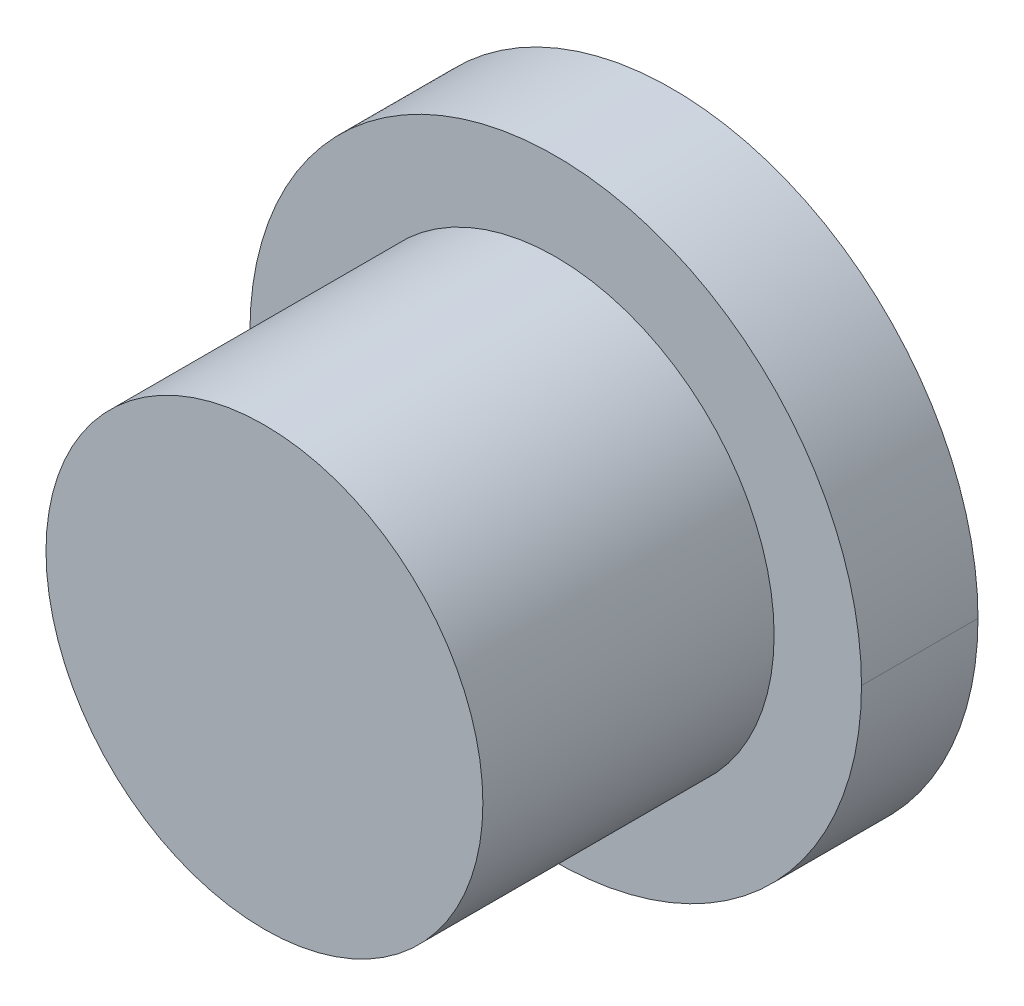
ISO-10303-21;
HEADER;
FILE_DESCRIPTION(('STEP AP214'),'2;1');
FILE_NAME('part.step','',(''),(''),'','','');
FILE_SCHEMA(('AUTOMOTIVE_DESIGN { 1 0 10303 214 1 1 1 1 }'));
ENDSEC;
DATA;
#1=APPLICATION_CONTEXT('core data for automotive mechanical design processes');
#2=APPLICATION_PROTOCOL_DEFINITION('international standard','automotive_design',2000,#1);
#3=PRODUCT_CONTEXT('',#1,'mechanical');
#4=PRODUCT('Part','Part','',(#3));
#5=PRODUCT_RELATED_PRODUCT_CATEGORY('part','',(#4));
#6=PRODUCT_DEFINITION_FORMATION('','',#4);
#7=PRODUCT_DEFINITION_CONTEXT('part definition',#1,'design');
#8=PRODUCT_DEFINITION('design','',#6,#7);
#9=PRODUCT_DEFINITION_SHAPE('','',#8);
#10=(LENGTH_UNIT() NAMED_UNIT(*) SI_UNIT(.MILLI.,.METRE.));
#11=(NAMED_UNIT(*) PLANE_ANGLE_UNIT() SI_UNIT($,.RADIAN.));
#12=(NAMED_UNIT(*) SI_UNIT($,.STERADIAN.) SOLID_ANGLE_UNIT());
#13=UNCERTAINTY_MEASURE_WITH_UNIT(LENGTH_MEASURE(1.E-05),#10,'distance_accuracy_value','');
#14=(GEOMETRIC_REPRESENTATION_CONTEXT(3) GLOBAL_UNCERTAINTY_ASSIGNED_CONTEXT((#13)) GLOBAL_UNIT_ASSIGNED_CONTEXT((#10,
#11,#12)) REPRESENTATION_CONTEXT('',''));
#15=CARTESIAN_POINT('',(0.,0.,0.));
#16=DIRECTION('',(0.,0.,1.));
#17=DIRECTION('',(1.,0.,0.));
#18=AXIS2_PLACEMENT_3D('',#15,#16,#17);
#19=CARTESIAN_POINT('',(0.,0.,-4.));
#20=DIRECTION('',(0.,0.,1.));
#21=DIRECTION('',(1.,0.,0.));
#22=AXIS2_PLACEMENT_3D('',#19,#20,#21);
#23=CYLINDRICAL_SURFACE('',#22,10.5);
#24=CARTESIAN_POINT('',(0.,0.,-4.));
#25=DIRECTION('',(0.,0.,-1.));
#26=DIRECTION('',(-1.,0.,0.));
#27=AXIS2_PLACEMENT_3D('',#24,#25,#26);
#28=CIRCLE('',#27,10.5);
#29=CARTESIAN_POINT('',(-10.5,0.,-4.));
#30=VERTEX_POINT('',#29);
#31=CARTESIAN_POINT('',(10.5,0.,-4.));
#32=VERTEX_POINT('',#31);
#33=EDGE_CURVE('E75',#30,#32,#28,.T.);
#34=ORIENTED_EDGE('',*,*,#33,.F.);
#35=DIRECTION('',(0.,0.,1.));
#36=VECTOR('',#35,1.);
#37=CARTESIAN_POINT('',(-10.5,0.,-4.));
#38=LINE('',#37,#36);
#39=CARTESIAN_POINT('',(-10.5,0.,0.));
#40=VERTEX_POINT('',#39);
#41=EDGE_CURVE('E11',#30,#40,#38,.T.);
#42=ORIENTED_EDGE('',*,*,#41,.T.);
#43=CARTESIAN_POINT('',(0.,0.,0.));
#44=DIRECTION('',(0.,0.,-1.));
#45=DIRECTION('',(-1.,0.,0.));
#46=AXIS2_PLACEMENT_3D('',#43,#44,#45);
#47=CIRCLE('',#46,10.5);
#48=CARTESIAN_POINT('',(10.5,0.,0.));
#49=VERTEX_POINT('',#48);
#50=EDGE_CURVE('E62',#40,#49,#47,.T.);
#51=ORIENTED_EDGE('',*,*,#50,.T.);
#52=DIRECTION('',(0.,0.,1.));
#53=VECTOR('',#52,1.);
#54=CARTESIAN_POINT('',(10.5,0.,-4.));
#55=LINE('',#54,#53);
#56=EDGE_CURVE('E118',#32,#49,#55,.T.);
#57=ORIENTED_EDGE('',*,*,#56,.F.);
#58=EDGE_LOOP('',(#34,#42,#51,#57));
#59=FACE_BOUND('',#58,.T.);
#60=ADVANCED_FACE('F51',(#59),#23,.T.);
#61=CARTESIAN_POINT('',(0.,0.,5.));
#62=DIRECTION('',(0.,0.,-1.));
#63=DIRECTION('',(-1.,0.,0.));
#64=AXIS2_PLACEMENT_3D('',#61,#62,#63);
#65=CYLINDRICAL_SURFACE('',#64,7.5);
#66=DIRECTION('',(0.,0.,-1.));
#67=VECTOR('',#66,1.);
#68=CARTESIAN_POINT('',(-7.5,0.,5.));
#69=LINE('',#68,#67);
#70=CARTESIAN_POINT('',(-7.5,0.,5.));
#71=VERTEX_POINT('',#70);
#72=CARTESIAN_POINT('',(-7.5,0.,0.));
#73=VERTEX_POINT('',#72);
#74=EDGE_CURVE('E112',#71,#73,#69,.T.);
#75=ORIENTED_EDGE('',*,*,#74,.F.);
#76=ORIENTED_EDGE('',*,*,#74,.T.);
#77=CARTESIAN_POINT('',(0.,0.,0.));
#78=DIRECTION('',(0.,0.,1.));
#79=DIRECTION('',(1.,0.,0.));
#80=AXIS2_PLACEMENT_3D('',#77,#78,#79);
#81=CIRCLE('',#80,7.5);
#82=CARTESIAN_POINT('',(7.5,0.,0.));
#83=VERTEX_POINT('',#82);
#84=EDGE_CURVE('E109',#73,#83,#81,.T.);
#85=ORIENTED_EDGE('',*,*,#84,.T.);
#86=DIRECTION('',(0.,0.,-1.));
#87=VECTOR('',#86,1.);
#88=CARTESIAN_POINT('',(7.5,0.,5.));
#89=LINE('',#88,#87);
#90=CARTESIAN_POINT('',(7.5,0.,5.));
#91=VERTEX_POINT('',#90);
#92=EDGE_CURVE('E99',#91,#83,#89,.T.);
#93=ORIENTED_EDGE('',*,*,#92,.F.);
#94=ORIENTED_EDGE('',*,*,#92,.T.);
#95=CARTESIAN_POINT('',(0.,0.,0.));
#96=DIRECTION('',(0.,0.,1.));
#97=DIRECTION('',(1.,0.,0.));
#98=AXIS2_PLACEMENT_3D('',#95,#96,#97);
#99=CIRCLE('',#98,7.5);
#100=EDGE_CURVE('E107',#83,#73,#99,.T.);
#101=ORIENTED_EDGE('',*,*,#100,.T.);
#102=EDGE_LOOP('',(#75,#76,#85,#93,#94,#101));
#103=FACE_BOUND('',#102,.T.);
#104=CARTESIAN_POINT('',(0.,0.,10.));
#105=DIRECTION('',(0.,0.,1.));
#106=DIRECTION('',(1.,0.,0.));
#107=AXIS2_PLACEMENT_3D('',#104,#105,#106);
#108=CIRCLE('',#107,7.5);
#109=CARTESIAN_POINT('',(7.5,0.,10.));
#110=VERTEX_POINT('',#109);
#111=EDGE_CURVE('E196',#110,#110,#108,.T.);
#112=ORIENTED_EDGE('',*,*,#111,.F.);
#113=EDGE_LOOP('',(#112));
#114=FACE_BOUND('',#113,.T.);
#115=ADVANCED_FACE('F114',(#103,#114),#65,.T.);
#116=CARTESIAN_POINT('',(0.,0.,-4.));
#117=DIRECTION('',(0.,0.,1.));
#118=DIRECTION('',(1.,0.,0.));
#119=AXIS2_PLACEMENT_3D('',#116,#117,#118);
#120=CYLINDRICAL_SURFACE('',#119,10.5);
#121=ORIENTED_EDGE('',*,*,#41,.F.);
#122=CARTESIAN_POINT('',(0.,0.,-4.));
#123=DIRECTION('',(0.,0.,-1.));
#124=DIRECTION('',(-1.,0.,0.));
#125=AXIS2_PLACEMENT_3D('',#122,#123,#124);
#126=CIRCLE('',#125,10.5);
#127=EDGE_CURVE('E128',#32,#30,#126,.T.);
#128=ORIENTED_EDGE('',*,*,#127,.F.);
#129=ORIENTED_EDGE('',*,*,#56,.T.);
#130=CARTESIAN_POINT('',(0.,0.,0.));
#131=DIRECTION('',(0.,0.,-1.));
#132=DIRECTION('',(-1.,0.,0.));
#133=AXIS2_PLACEMENT_3D('',#130,#131,#132);
#134=CIRCLE('',#133,10.5);
#135=EDGE_CURVE('E124',#49,#40,#134,.T.);
#136=ORIENTED_EDGE('',*,*,#135,.T.);
#137=EDGE_LOOP('',(#121,#128,#129,#136));
#138=FACE_BOUND('',#137,.T.);
#139=ADVANCED_FACE('F159',(#138),#120,.T.);
#140=CARTESIAN_POINT('',(0.,0.,-4.));
#141=DIRECTION('',(0.,0.,-1.));
#142=DIRECTION('',(0.,-1.,0.));
#143=AXIS2_PLACEMENT_3D('',#140,#141,#142);
#144=PLANE('',#143);
#145=CARTESIAN_POINT('',(0.,0.,-4.));
#146=DIRECTION('',(0.,0.,-1.));
#147=DIRECTION('',(0.,1.,0.));
#148=AXIS2_PLACEMENT_3D('',#145,#146,#147);
#149=CIRCLE('',#148,9.75);
#150=CARTESIAN_POINT('',(0.,9.75,-4.));
#151=VERTEX_POINT('',#150);
#152=EDGE_CURVE('E149',#151,#151,#149,.T.);
#153=ORIENTED_EDGE('',*,*,#152,.F.);
#154=EDGE_LOOP('',(#153));
#155=FACE_BOUND('',#154,.T.);
#156=ORIENTED_EDGE('',*,*,#127,.T.);
#157=ORIENTED_EDGE('',*,*,#33,.T.);
#158=EDGE_LOOP('',(#156,#157));
#159=FACE_BOUND('',#158,.T.);
#160=ADVANCED_FACE('F160',(#155,#159),#144,.T.);
#161=CARTESIAN_POINT('',(0.,0.,0.));
#162=DIRECTION('',(0.,0.,-1.));
#163=DIRECTION('',(0.,-1.,0.));
#164=AXIS2_PLACEMENT_3D('',#161,#162,#163);
#165=PLANE('',#164);
#166=ORIENTED_EDGE('',*,*,#135,.F.);
#167=ORIENTED_EDGE('',*,*,#50,.F.);
#168=EDGE_LOOP('',(#166,#167));
#169=FACE_BOUND('',#168,.T.);
#170=ORIENTED_EDGE('',*,*,#84,.F.);
#171=ORIENTED_EDGE('',*,*,#100,.F.);
#172=EDGE_LOOP('',(#170,#171));
#173=FACE_BOUND('',#172,.T.);
#174=ADVANCED_FACE('F108',(#169,#173),#165,.F.);
#175=CARTESIAN_POINT('',(0.,0.,-4.));
#176=DIRECTION('',(0.,0.,-1.));
#177=DIRECTION('',(0.,1.,0.));
#178=AXIS2_PLACEMENT_3D('',#175,#176,#177);
#179=CONICAL_SURFACE('',#178,9.75,0.785398163397447);
#180=CARTESIAN_POINT('',(0.,0.,-3.25));
#181=DIRECTION('',(0.,0.,-1.));
#182=DIRECTION('',(0.,1.,0.));
#183=AXIS2_PLACEMENT_3D('',#180,#181,#182);
#184=CIRCLE('',#183,9.);
#185=CARTESIAN_POINT('',(0.,9.,-3.25));
#186=VERTEX_POINT('',#185);
#187=EDGE_CURVE('E143',#186,#186,#184,.T.);
#188=ORIENTED_EDGE('',*,*,#187,.F.);
#189=EDGE_LOOP('',(#188));
#190=FACE_BOUND('',#189,.T.);
#191=ORIENTED_EDGE('',*,*,#152,.T.);
#192=EDGE_LOOP('',(#191));
#193=FACE_BOUND('',#192,.T.);
#194=ADVANCED_FACE('F168',(#190,#193),#179,.F.);
#195=CARTESIAN_POINT('',(0.,0.,-1.));
#196=DIRECTION('',(0.,0.,-1.));
#197=DIRECTION('',(0.,-1.,0.));
#198=AXIS2_PLACEMENT_3D('',#195,#196,#197);
#199=PLANE('',#198);
#200=CARTESIAN_POINT('',(0.,0.,-1.));
#201=DIRECTION('',(0.,0.,-1.));
#202=DIRECTION('',(-1.,0.,0.));
#203=AXIS2_PLACEMENT_3D('',#200,#201,#202);
#204=CIRCLE('',#203,9.);
#205=CARTESIAN_POINT('',(-9.,0.,-1.));
#206=VERTEX_POINT('',#205);
#207=EDGE_CURVE('E136',#206,#206,#204,.T.);
#208=ORIENTED_EDGE('',*,*,#207,.T.);
#209=EDGE_LOOP('',(#208));
#210=FACE_BOUND('',#209,.T.);
#211=ADVANCED_FACE('F53',(#210),#199,.T.);
#212=CARTESIAN_POINT('',(0.,0.,-1.));
#213=DIRECTION('',(0.,0.,-1.));
#214=DIRECTION('',(-1.,0.,0.));
#215=AXIS2_PLACEMENT_3D('',#212,#213,#214);
#216=CYLINDRICAL_SURFACE('',#215,9.);
#217=ORIENTED_EDGE('',*,*,#187,.T.);
#218=EDGE_LOOP('',(#217));
#219=FACE_BOUND('',#218,.T.);
#220=ORIENTED_EDGE('',*,*,#207,.F.);
#221=EDGE_LOOP('',(#220));
#222=FACE_BOUND('',#221,.T.);
#223=ADVANCED_FACE('F182',(#219,#222),#216,.F.);
#224=CARTESIAN_POINT('',(0.,0.,10.));
#225=DIRECTION('',(0.,0.,1.));
#226=DIRECTION('',(1.,0.,0.));
#227=AXIS2_PLACEMENT_3D('',#224,#225,#226);
#228=PLANE('',#227);
#229=ORIENTED_EDGE('',*,*,#111,.T.);
#230=EDGE_LOOP('',(#229));
#231=FACE_BOUND('',#230,.T.);
#232=ADVANCED_FACE('F185',(#231),#228,.T.);
#233=CLOSED_SHELL('',(#60,#115,#139,#160,#174,#194,#211,#223,#232));
#234=MANIFOLD_SOLID_BREP('B2',#233);
#235=ADVANCED_BREP_SHAPE_REPRESENTATION('',(#18,#234),#14);
#236=SHAPE_DEFINITION_REPRESENTATION(#9,#235);
ENDSEC;
END-ISO-10303-21;
